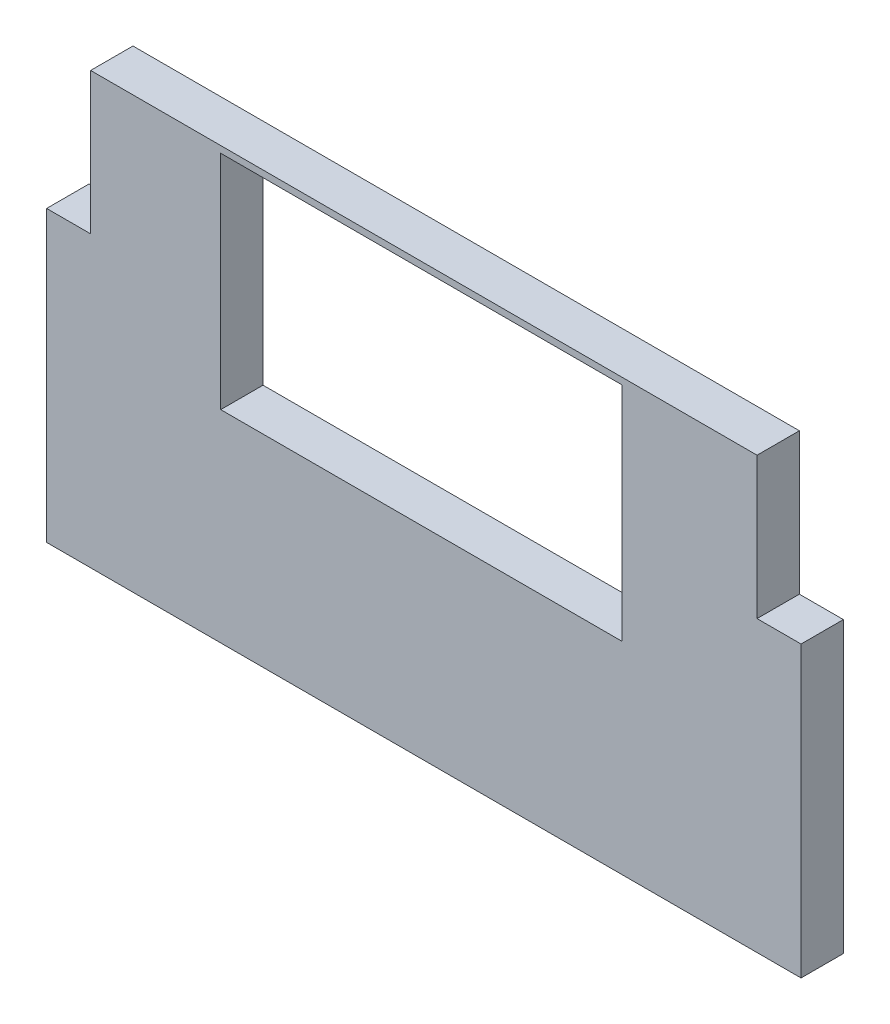
ISO-10303-21;
HEADER;
FILE_DESCRIPTION(('STEP AP214'),'2;1');
FILE_NAME('part.step','',(''),(''),'','','');
FILE_SCHEMA(('AUTOMOTIVE_DESIGN { 1 0 10303 214 1 1 1 1 }'));
ENDSEC;
DATA;
#1=APPLICATION_CONTEXT('core data for automotive mechanical design processes');
#2=APPLICATION_PROTOCOL_DEFINITION('international standard','automotive_design',2000,#1);
#3=PRODUCT_CONTEXT('',#1,'mechanical');
#4=PRODUCT('Part','Part','',(#3));
#5=PRODUCT_RELATED_PRODUCT_CATEGORY('part','',(#4));
#6=PRODUCT_DEFINITION_FORMATION('','',#4);
#7=PRODUCT_DEFINITION_CONTEXT('part definition',#1,'design');
#8=PRODUCT_DEFINITION('design','',#6,#7);
#9=PRODUCT_DEFINITION_SHAPE('','',#8);
#10=(LENGTH_UNIT() NAMED_UNIT(*) SI_UNIT(.MILLI.,.METRE.));
#11=(NAMED_UNIT(*) PLANE_ANGLE_UNIT() SI_UNIT($,.RADIAN.));
#12=(NAMED_UNIT(*) SI_UNIT($,.STERADIAN.) SOLID_ANGLE_UNIT());
#13=UNCERTAINTY_MEASURE_WITH_UNIT(LENGTH_MEASURE(1.E-05),#10,'distance_accuracy_value','');
#14=(GEOMETRIC_REPRESENTATION_CONTEXT(3) GLOBAL_UNCERTAINTY_ASSIGNED_CONTEXT((#13)) GLOBAL_UNIT_ASSIGNED_CONTEXT((#10,
#11,#12)) REPRESENTATION_CONTEXT('',''));
#15=CARTESIAN_POINT('',(0.,0.,0.));
#16=DIRECTION('',(0.,0.,1.));
#17=DIRECTION('',(1.,0.,0.));
#18=AXIS2_PLACEMENT_3D('',#15,#16,#17);
#19=CARTESIAN_POINT('',(0.,0.,3.175));
#20=DIRECTION('',(0.,0.,-1.));
#21=DIRECTION('',(-1.,0.,0.));
#22=AXIS2_PLACEMENT_3D('',#19,#20,#21);
#23=PLANE('',#22);
#24=DIRECTION('',(1.,0.,0.));
#25=VECTOR('',#24,1.);
#26=CARTESIAN_POINT('',(48.9804120830226,2.21128549851933,3.175));
#27=LINE('',#26,#25);
#28=CARTESIAN_POINT('',(-7.62358791697743,2.21128549851933,3.175));
#29=VERTEX_POINT('',#28);
#30=CARTESIAN_POINT('',(48.9804120830226,2.21128549851933,3.175));
#31=VERTEX_POINT('',#30);
#32=EDGE_CURVE('E161',#29,#31,#27,.T.);
#33=ORIENTED_EDGE('',*,*,#32,.T.);
#34=DIRECTION('',(0.,1.,0.));
#35=VECTOR('',#34,1.);
#36=CARTESIAN_POINT('',(48.9804120830226,23.9132855285193,3.175));
#37=LINE('',#36,#35);
#38=CARTESIAN_POINT('',(48.9804120830226,23.9132855285193,3.175));
#39=VERTEX_POINT('',#38);
#40=EDGE_CURVE('E164',#31,#39,#37,.T.);
#41=ORIENTED_EDGE('',*,*,#40,.T.);
#42=DIRECTION('',(-1.,0.,0.));
#43=VECTOR('',#42,1.);
#44=CARTESIAN_POINT('',(45.6784120830226,23.9132855285193,3.175));
#45=LINE('',#44,#43);
#46=CARTESIAN_POINT('',(45.6784120830226,23.9132855285193,3.175));
#47=VERTEX_POINT('',#46);
#48=EDGE_CURVE('E167',#39,#47,#45,.T.);
#49=ORIENTED_EDGE('',*,*,#48,.T.);
#50=DIRECTION('',(0.,1.,0.));
#51=VECTOR('',#50,1.);
#52=CARTESIAN_POINT('',(45.6784120830226,34.5312854985193,3.175));
#53=LINE('',#52,#51);
#54=CARTESIAN_POINT('',(45.6784120830226,34.5312854985193,3.175));
#55=VERTEX_POINT('',#54);
#56=EDGE_CURVE('E169',#47,#55,#53,.T.);
#57=ORIENTED_EDGE('',*,*,#56,.T.);
#58=DIRECTION('',(-1.,0.,0.));
#59=VECTOR('',#58,1.);
#60=CARTESIAN_POINT('',(-4.32158791697743,34.5312854985193,3.175));
#61=LINE('',#60,#59);
#62=CARTESIAN_POINT('',(-4.32158791697743,34.5312854985193,3.175));
#63=VERTEX_POINT('',#62);
#64=EDGE_CURVE('E171',#55,#63,#61,.T.);
#65=ORIENTED_EDGE('',*,*,#64,.T.);
#66=DIRECTION('',(0.,-1.,0.));
#67=VECTOR('',#66,1.);
#68=CARTESIAN_POINT('',(-4.32158791697743,23.9132855285193,3.175));
#69=LINE('',#68,#67);
#70=CARTESIAN_POINT('',(-4.32158791697743,23.9132855285193,3.175));
#71=VERTEX_POINT('',#70);
#72=EDGE_CURVE('E173',#63,#71,#69,.T.);
#73=ORIENTED_EDGE('',*,*,#72,.T.);
#74=DIRECTION('',(-1.,0.,0.));
#75=VECTOR('',#74,1.);
#76=CARTESIAN_POINT('',(-7.62358791697743,23.9132855285193,3.175));
#77=LINE('',#76,#75);
#78=CARTESIAN_POINT('',(-7.62358791697743,23.9132855285193,3.175));
#79=VERTEX_POINT('',#78);
#80=EDGE_CURVE('E175',#71,#79,#77,.T.);
#81=ORIENTED_EDGE('',*,*,#80,.T.);
#82=DIRECTION('',(0.,-1.,0.));
#83=VECTOR('',#82,1.);
#84=CARTESIAN_POINT('',(-7.62358791697743,2.21128549851933,3.175));
#85=LINE('',#84,#83);
#86=EDGE_CURVE('E177',#79,#29,#85,.T.);
#87=ORIENTED_EDGE('',*,*,#86,.T.);
#88=EDGE_LOOP('',(#33,#41,#49,#57,#65,#73,#81,#87));
#89=FACE_BOUND('',#88,.T.);
#90=DIRECTION('',(0.,-1.,0.));
#91=VECTOR('',#90,1.);
#92=CARTESIAN_POINT('',(5.43841208302234,34.0312854985174,3.175));
#93=LINE('',#92,#91);
#94=CARTESIAN_POINT('',(5.43841208302234,34.0312854985174,3.175));
#95=VERTEX_POINT('',#94);
#96=CARTESIAN_POINT('',(5.43841208302234,17.3712854985174,3.175));
#97=VERTEX_POINT('',#96);
#98=EDGE_CURVE('E125',#95,#97,#93,.T.);
#99=ORIENTED_EDGE('',*,*,#98,.F.);
#100=DIRECTION('',(-1.,0.,0.));
#101=VECTOR('',#100,1.);
#102=CARTESIAN_POINT('',(5.43841208302234,34.0312854985174,3.175));
#103=LINE('',#102,#101);
#104=CARTESIAN_POINT('',(35.5384120830223,34.0312854985174,3.175));
#105=VERTEX_POINT('',#104);
#106=EDGE_CURVE('E147',#105,#95,#103,.T.);
#107=ORIENTED_EDGE('',*,*,#106,.F.);
#108=DIRECTION('',(0.,1.,0.));
#109=VECTOR('',#108,1.);
#110=CARTESIAN_POINT('',(35.5384120830223,34.0312854985174,3.175));
#111=LINE('',#110,#109);
#112=CARTESIAN_POINT('',(35.5384120830223,17.3712854985174,3.175));
#113=VERTEX_POINT('',#112);
#114=EDGE_CURVE('E145',#113,#105,#111,.T.);
#115=ORIENTED_EDGE('',*,*,#114,.F.);
#116=DIRECTION('',(1.,0.,0.));
#117=VECTOR('',#116,1.);
#118=CARTESIAN_POINT('',(5.43841208302234,17.3712854985174,3.175));
#119=LINE('',#118,#117);
#120=EDGE_CURVE('E133',#97,#113,#119,.T.);
#121=ORIENTED_EDGE('',*,*,#120,.F.);
#122=EDGE_LOOP('',(#99,#107,#115,#121));
#123=FACE_BOUND('',#122,.T.);
#124=ADVANCED_FACE('F36',(#89,#123),#23,.F.);
#125=CARTESIAN_POINT('',(0.,0.,0.));
#126=DIRECTION('',(0.,0.,-1.));
#127=DIRECTION('',(-1.,0.,0.));
#128=AXIS2_PLACEMENT_3D('',#125,#126,#127);
#129=PLANE('',#128);
#130=DIRECTION('',(1.,0.,0.));
#131=VECTOR('',#130,1.);
#132=CARTESIAN_POINT('',(48.9804120830226,2.21128549851933,0.));
#133=LINE('',#132,#131);
#134=CARTESIAN_POINT('',(-7.62358791697743,2.21128549851933,0.));
#135=VERTEX_POINT('',#134);
#136=CARTESIAN_POINT('',(48.9804120830226,2.21128549851933,0.));
#137=VERTEX_POINT('',#136);
#138=EDGE_CURVE('E141',#135,#137,#133,.T.);
#139=ORIENTED_EDGE('',*,*,#138,.F.);
#140=DIRECTION('',(0.,-1.,0.));
#141=VECTOR('',#140,1.);
#142=CARTESIAN_POINT('',(-7.62358791697743,2.21128549851933,0.));
#143=LINE('',#142,#141);
#144=CARTESIAN_POINT('',(-7.62358791697743,23.9132855285193,0.));
#145=VERTEX_POINT('',#144);
#146=EDGE_CURVE('E165',#145,#135,#143,.T.);
#147=ORIENTED_EDGE('',*,*,#146,.F.);
#148=DIRECTION('',(-1.,0.,0.));
#149=VECTOR('',#148,1.);
#150=CARTESIAN_POINT('',(-7.62358791697743,23.9132855285193,0.));
#151=LINE('',#150,#149);
#152=CARTESIAN_POINT('',(-4.32158791697743,23.9132855285193,0.));
#153=VERTEX_POINT('',#152);
#154=EDGE_CURVE('E192',#153,#145,#151,.T.);
#155=ORIENTED_EDGE('',*,*,#154,.F.);
#156=DIRECTION('',(0.,-1.,0.));
#157=VECTOR('',#156,1.);
#158=CARTESIAN_POINT('',(-4.32158791697743,23.9132855285193,0.));
#159=LINE('',#158,#157);
#160=CARTESIAN_POINT('',(-4.32158791697743,34.5312854985193,0.));
#161=VERTEX_POINT('',#160);
#162=EDGE_CURVE('E190',#161,#153,#159,.T.);
#163=ORIENTED_EDGE('',*,*,#162,.F.);
#164=DIRECTION('',(-1.,0.,0.));
#165=VECTOR('',#164,1.);
#166=CARTESIAN_POINT('',(-4.32158791697743,34.5312854985193,0.));
#167=LINE('',#166,#165);
#168=CARTESIAN_POINT('',(45.6784120830226,34.5312854985193,0.));
#169=VERTEX_POINT('',#168);
#170=EDGE_CURVE('E188',#169,#161,#167,.T.);
#171=ORIENTED_EDGE('',*,*,#170,.F.);
#172=DIRECTION('',(0.,1.,0.));
#173=VECTOR('',#172,1.);
#174=CARTESIAN_POINT('',(45.6784120830226,34.5312854985193,0.));
#175=LINE('',#174,#173);
#176=CARTESIAN_POINT('',(45.6784120830226,23.9132855285193,0.));
#177=VERTEX_POINT('',#176);
#178=EDGE_CURVE('E186',#177,#169,#175,.T.);
#179=ORIENTED_EDGE('',*,*,#178,.F.);
#180=DIRECTION('',(-1.,0.,0.));
#181=VECTOR('',#180,1.);
#182=CARTESIAN_POINT('',(45.6784120830226,23.9132855285193,0.));
#183=LINE('',#182,#181);
#184=CARTESIAN_POINT('',(48.9804120830226,23.9132855285193,0.));
#185=VERTEX_POINT('',#184);
#186=EDGE_CURVE('E184',#185,#177,#183,.T.);
#187=ORIENTED_EDGE('',*,*,#186,.F.);
#188=DIRECTION('',(0.,1.,0.));
#189=VECTOR('',#188,1.);
#190=CARTESIAN_POINT('',(48.9804120830226,23.9132855285193,0.));
#191=LINE('',#190,#189);
#192=EDGE_CURVE('E182',#137,#185,#191,.T.);
#193=ORIENTED_EDGE('',*,*,#192,.F.);
#194=EDGE_LOOP('',(#139,#147,#155,#163,#171,#179,#187,#193));
#195=FACE_BOUND('',#194,.T.);
#196=DIRECTION('',(-1.,0.,0.));
#197=VECTOR('',#196,1.);
#198=CARTESIAN_POINT('',(5.43841208302234,34.0312854985174,0.));
#199=LINE('',#198,#197);
#200=CARTESIAN_POINT('',(35.5384120830223,34.0312854985174,0.));
#201=VERTEX_POINT('',#200);
#202=CARTESIAN_POINT('',(5.43841208302234,34.0312854985174,0.));
#203=VERTEX_POINT('',#202);
#204=EDGE_CURVE('E134',#201,#203,#199,.T.);
#205=ORIENTED_EDGE('',*,*,#204,.T.);
#206=DIRECTION('',(0.,-1.,0.));
#207=VECTOR('',#206,1.);
#208=CARTESIAN_POINT('',(5.43841208302234,34.0312854985174,0.));
#209=LINE('',#208,#207);
#210=CARTESIAN_POINT('',(5.43841208302234,17.3712854985174,0.));
#211=VERTEX_POINT('',#210);
#212=EDGE_CURVE('E59',#203,#211,#209,.T.);
#213=ORIENTED_EDGE('',*,*,#212,.T.);
#214=DIRECTION('',(1.,0.,0.));
#215=VECTOR('',#214,1.);
#216=CARTESIAN_POINT('',(5.43841208302234,17.3712854985174,0.));
#217=LINE('',#216,#215);
#218=CARTESIAN_POINT('',(35.5384120830223,17.3712854985174,0.));
#219=VERTEX_POINT('',#218);
#220=EDGE_CURVE('E140',#211,#219,#217,.T.);
#221=ORIENTED_EDGE('',*,*,#220,.T.);
#222=DIRECTION('',(0.,1.,0.));
#223=VECTOR('',#222,1.);
#224=CARTESIAN_POINT('',(35.5384120830223,34.0312854985174,0.));
#225=LINE('',#224,#223);
#226=EDGE_CURVE('E153',#219,#201,#225,.T.);
#227=ORIENTED_EDGE('',*,*,#226,.T.);
#228=EDGE_LOOP('',(#205,#213,#221,#227));
#229=FACE_BOUND('',#228,.T.);
#230=ADVANCED_FACE('F222',(#195,#229),#129,.T.);
#231=CARTESIAN_POINT('',(48.9804120830226,2.21128549851933,3.175));
#232=DIRECTION('',(0.,1.,0.));
#233=DIRECTION('',(-1.,0.,0.));
#234=AXIS2_PLACEMENT_3D('',#231,#232,#233);
#235=PLANE('',#234);
#236=ORIENTED_EDGE('',*,*,#138,.T.);
#237=DIRECTION('',(0.,0.,-1.));
#238=VECTOR('',#237,1.);
#239=CARTESIAN_POINT('',(48.9804120830226,2.21128549851933,3.175));
#240=LINE('',#239,#238);
#241=EDGE_CURVE('E11',#31,#137,#240,.T.);
#242=ORIENTED_EDGE('',*,*,#241,.F.);
#243=ORIENTED_EDGE('',*,*,#32,.F.);
#244=DIRECTION('',(0.,0.,-1.));
#245=VECTOR('',#244,1.);
#246=CARTESIAN_POINT('',(-7.62358791697743,2.21128549851933,3.175));
#247=LINE('',#246,#245);
#248=EDGE_CURVE('E179',#29,#135,#247,.T.);
#249=ORIENTED_EDGE('',*,*,#248,.T.);
#250=EDGE_LOOP('',(#236,#242,#243,#249));
#251=FACE_BOUND('',#250,.T.);
#252=ADVANCED_FACE('F38',(#251),#235,.F.);
#253=CARTESIAN_POINT('',(48.9804120830226,23.9132855285193,3.175));
#254=DIRECTION('',(-1.,0.,0.));
#255=DIRECTION('',(0.,0.,1.));
#256=AXIS2_PLACEMENT_3D('',#253,#254,#255);
#257=PLANE('',#256);
#258=ORIENTED_EDGE('',*,*,#192,.T.);
#259=DIRECTION('',(0.,0.,-1.));
#260=VECTOR('',#259,1.);
#261=CARTESIAN_POINT('',(48.9804120830226,23.9132855285193,3.175));
#262=LINE('',#261,#260);
#263=EDGE_CURVE('E44',#39,#185,#262,.T.);
#264=ORIENTED_EDGE('',*,*,#263,.F.);
#265=ORIENTED_EDGE('',*,*,#40,.F.);
#266=ORIENTED_EDGE('',*,*,#241,.T.);
#267=EDGE_LOOP('',(#258,#264,#265,#266));
#268=FACE_BOUND('',#267,.T.);
#269=ADVANCED_FACE('F239',(#268),#257,.F.);
#270=CARTESIAN_POINT('',(45.6784120830226,23.9132855285193,3.175));
#271=DIRECTION('',(0.,-1.,0.));
#272=DIRECTION('',(0.,0.,-1.));
#273=AXIS2_PLACEMENT_3D('',#270,#271,#272);
#274=PLANE('',#273);
#275=ORIENTED_EDGE('',*,*,#186,.T.);
#276=DIRECTION('',(0.,0.,-1.));
#277=VECTOR('',#276,1.);
#278=CARTESIAN_POINT('',(45.6784120830226,23.9132855285193,3.175));
#279=LINE('',#278,#277);
#280=EDGE_CURVE('E209',#47,#177,#279,.T.);
#281=ORIENTED_EDGE('',*,*,#280,.F.);
#282=ORIENTED_EDGE('',*,*,#48,.F.);
#283=ORIENTED_EDGE('',*,*,#263,.T.);
#284=EDGE_LOOP('',(#275,#281,#282,#283));
#285=FACE_BOUND('',#284,.T.);
#286=ADVANCED_FACE('F216',(#285),#274,.F.);
#287=CARTESIAN_POINT('',(45.6784120830226,34.5312854985193,3.175));
#288=DIRECTION('',(-1.,0.,0.));
#289=DIRECTION('',(0.,0.,1.));
#290=AXIS2_PLACEMENT_3D('',#287,#288,#289);
#291=PLANE('',#290);
#292=ORIENTED_EDGE('',*,*,#178,.T.);
#293=DIRECTION('',(0.,0.,-1.));
#294=VECTOR('',#293,1.);
#295=CARTESIAN_POINT('',(45.6784120830226,34.5312854985193,3.175));
#296=LINE('',#295,#294);
#297=EDGE_CURVE('E206',#55,#169,#296,.T.);
#298=ORIENTED_EDGE('',*,*,#297,.F.);
#299=ORIENTED_EDGE('',*,*,#56,.F.);
#300=ORIENTED_EDGE('',*,*,#280,.T.);
#301=EDGE_LOOP('',(#292,#298,#299,#300));
#302=FACE_BOUND('',#301,.T.);
#303=ADVANCED_FACE('F228',(#302),#291,.F.);
#304=CARTESIAN_POINT('',(-4.32158791697743,34.5312854985193,3.175));
#305=DIRECTION('',(0.,-1.,0.));
#306=DIRECTION('',(0.,0.,-1.));
#307=AXIS2_PLACEMENT_3D('',#304,#305,#306);
#308=PLANE('',#307);
#309=ORIENTED_EDGE('',*,*,#170,.T.);
#310=DIRECTION('',(0.,0.,-1.));
#311=VECTOR('',#310,1.);
#312=CARTESIAN_POINT('',(-4.32158791697743,34.5312854985193,3.175));
#313=LINE('',#312,#311);
#314=EDGE_CURVE('E203',#63,#161,#313,.T.);
#315=ORIENTED_EDGE('',*,*,#314,.F.);
#316=ORIENTED_EDGE('',*,*,#64,.F.);
#317=ORIENTED_EDGE('',*,*,#297,.T.);
#318=EDGE_LOOP('',(#309,#315,#316,#317));
#319=FACE_BOUND('',#318,.T.);
#320=ADVANCED_FACE('F232',(#319),#308,.F.);
#321=CARTESIAN_POINT('',(-4.32158791697743,23.9132855285193,3.175));
#322=DIRECTION('',(1.,0.,0.));
#323=DIRECTION('',(0.,0.,-1.));
#324=AXIS2_PLACEMENT_3D('',#321,#322,#323);
#325=PLANE('',#324);
#326=ORIENTED_EDGE('',*,*,#162,.T.);
#327=DIRECTION('',(0.,0.,-1.));
#328=VECTOR('',#327,1.);
#329=CARTESIAN_POINT('',(-4.32158791697743,23.9132855285193,3.175));
#330=LINE('',#329,#328);
#331=EDGE_CURVE('E200',#71,#153,#330,.T.);
#332=ORIENTED_EDGE('',*,*,#331,.F.);
#333=ORIENTED_EDGE('',*,*,#72,.F.);
#334=ORIENTED_EDGE('',*,*,#314,.T.);
#335=EDGE_LOOP('',(#326,#332,#333,#334));
#336=FACE_BOUND('',#335,.T.);
#337=ADVANCED_FACE('F252',(#336),#325,.F.);
#338=CARTESIAN_POINT('',(-7.62358791697743,23.9132855285193,3.175));
#339=DIRECTION('',(0.,-1.,0.));
#340=DIRECTION('',(0.,0.,-1.));
#341=AXIS2_PLACEMENT_3D('',#338,#339,#340);
#342=PLANE('',#341);
#343=ORIENTED_EDGE('',*,*,#154,.T.);
#344=DIRECTION('',(0.,0.,-1.));
#345=VECTOR('',#344,1.);
#346=CARTESIAN_POINT('',(-7.62358791697743,23.9132855285193,3.175));
#347=LINE('',#346,#345);
#348=EDGE_CURVE('E197',#79,#145,#347,.T.);
#349=ORIENTED_EDGE('',*,*,#348,.F.);
#350=ORIENTED_EDGE('',*,*,#80,.F.);
#351=ORIENTED_EDGE('',*,*,#331,.T.);
#352=EDGE_LOOP('',(#343,#349,#350,#351));
#353=FACE_BOUND('',#352,.T.);
#354=ADVANCED_FACE('F250',(#353),#342,.F.);
#355=CARTESIAN_POINT('',(-7.62358791697743,2.21128549851933,3.175));
#356=DIRECTION('',(1.,0.,0.));
#357=DIRECTION('',(0.,1.,0.));
#358=AXIS2_PLACEMENT_3D('',#355,#356,#357);
#359=PLANE('',#358);
#360=ORIENTED_EDGE('',*,*,#146,.T.);
#361=ORIENTED_EDGE('',*,*,#248,.F.);
#362=ORIENTED_EDGE('',*,*,#86,.F.);
#363=ORIENTED_EDGE('',*,*,#348,.T.);
#364=EDGE_LOOP('',(#360,#361,#362,#363));
#365=FACE_BOUND('',#364,.T.);
#366=ADVANCED_FACE('F245',(#365),#359,.F.);
#367=CARTESIAN_POINT('',(5.43841208302234,34.0312854985174,3.175));
#368=DIRECTION('',(1.,0.,0.));
#369=DIRECTION('',(0.,1.,0.));
#370=AXIS2_PLACEMENT_3D('',#367,#368,#369);
#371=PLANE('',#370);
#372=ORIENTED_EDGE('',*,*,#212,.F.);
#373=DIRECTION('',(0.,0.,-1.));
#374=VECTOR('',#373,1.);
#375=CARTESIAN_POINT('',(5.43841208302234,34.0312854985174,3.175));
#376=LINE('',#375,#374);
#377=EDGE_CURVE('E129',#95,#203,#376,.T.);
#378=ORIENTED_EDGE('',*,*,#377,.F.);
#379=ORIENTED_EDGE('',*,*,#98,.T.);
#380=DIRECTION('',(0.,0.,-1.));
#381=VECTOR('',#380,1.);
#382=CARTESIAN_POINT('',(5.43841208302234,17.3712854985174,3.175));
#383=LINE('',#382,#381);
#384=EDGE_CURVE('E128',#97,#211,#383,.T.);
#385=ORIENTED_EDGE('',*,*,#384,.T.);
#386=EDGE_LOOP('',(#372,#378,#379,#385));
#387=FACE_BOUND('',#386,.T.);
#388=ADVANCED_FACE('F127',(#387),#371,.T.);
#389=CARTESIAN_POINT('',(5.43841208302234,17.3712854985174,3.175));
#390=DIRECTION('',(0.,1.,0.));
#391=DIRECTION('',(0.,0.,1.));
#392=AXIS2_PLACEMENT_3D('',#389,#390,#391);
#393=PLANE('',#392);
#394=ORIENTED_EDGE('',*,*,#220,.F.);
#395=ORIENTED_EDGE('',*,*,#384,.F.);
#396=ORIENTED_EDGE('',*,*,#120,.T.);
#397=DIRECTION('',(0.,0.,-1.));
#398=VECTOR('',#397,1.);
#399=CARTESIAN_POINT('',(35.5384120830223,17.3712854985174,3.175));
#400=LINE('',#399,#398);
#401=EDGE_CURVE('E142',#113,#219,#400,.T.);
#402=ORIENTED_EDGE('',*,*,#401,.T.);
#403=EDGE_LOOP('',(#394,#395,#396,#402));
#404=FACE_BOUND('',#403,.T.);
#405=ADVANCED_FACE('F137',(#404),#393,.T.);
#406=CARTESIAN_POINT('',(35.5384120830223,34.0312854985174,3.175));
#407=DIRECTION('',(-1.,0.,0.));
#408=DIRECTION('',(0.,-1.,0.));
#409=AXIS2_PLACEMENT_3D('',#406,#407,#408);
#410=PLANE('',#409);
#411=ORIENTED_EDGE('',*,*,#226,.F.);
#412=ORIENTED_EDGE('',*,*,#401,.F.);
#413=ORIENTED_EDGE('',*,*,#114,.T.);
#414=DIRECTION('',(0.,0.,-1.));
#415=VECTOR('',#414,1.);
#416=CARTESIAN_POINT('',(35.5384120830223,34.0312854985174,3.175));
#417=LINE('',#416,#415);
#418=EDGE_CURVE('E51',#105,#201,#417,.T.);
#419=ORIENTED_EDGE('',*,*,#418,.T.);
#420=EDGE_LOOP('',(#411,#412,#413,#419));
#421=FACE_BOUND('',#420,.T.);
#422=ADVANCED_FACE('F277',(#421),#410,.T.);
#423=CARTESIAN_POINT('',(5.43841208302234,34.0312854985174,3.175));
#424=DIRECTION('',(0.,-1.,0.));
#425=DIRECTION('',(0.,0.,-1.));
#426=AXIS2_PLACEMENT_3D('',#423,#424,#425);
#427=PLANE('',#426);
#428=ORIENTED_EDGE('',*,*,#204,.F.);
#429=ORIENTED_EDGE('',*,*,#418,.F.);
#430=ORIENTED_EDGE('',*,*,#106,.T.);
#431=ORIENTED_EDGE('',*,*,#377,.T.);
#432=EDGE_LOOP('',(#428,#429,#430,#431));
#433=FACE_BOUND('',#432,.T.);
#434=ADVANCED_FACE('F281',(#433),#427,.T.);
#435=CLOSED_SHELL('',(#124,#230,#252,#269,#286,#303,#320,#337,#354,#366,#388,#405,#422,#434));
#436=MANIFOLD_SOLID_BREP('B2',#435);
#437=ADVANCED_BREP_SHAPE_REPRESENTATION('',(#18,#436),#14);
#438=SHAPE_DEFINITION_REPRESENTATION(#9,#437);
ENDSEC;
END-ISO-10303-21;
